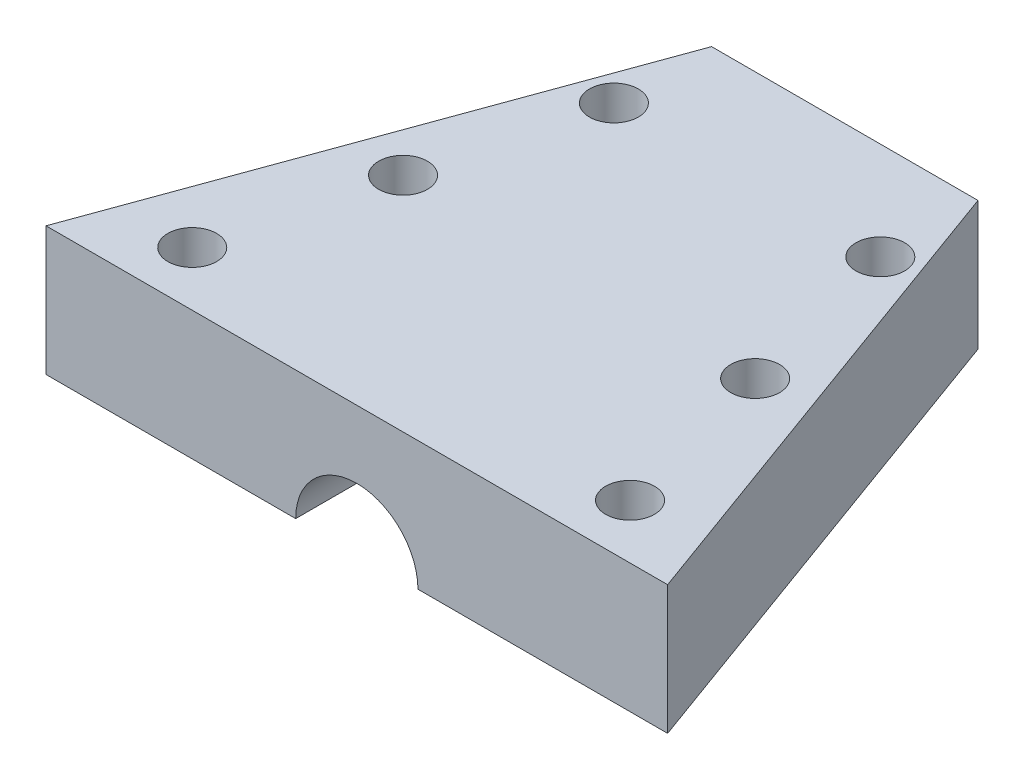
ISO-10303-21;
HEADER;
FILE_DESCRIPTION(('STEP AP214'),'2;1');
FILE_NAME('part.step','',(''),(''),'','','');
FILE_SCHEMA(('AUTOMOTIVE_DESIGN { 1 0 10303 214 1 1 1 1 }'));
ENDSEC;
DATA;
#1=APPLICATION_CONTEXT('core data for automotive mechanical design processes');
#2=APPLICATION_PROTOCOL_DEFINITION('international standard','automotive_design',2000,#1);
#3=PRODUCT_CONTEXT('',#1,'mechanical');
#4=PRODUCT('Part','Part','',(#3));
#5=PRODUCT_RELATED_PRODUCT_CATEGORY('part','',(#4));
#6=PRODUCT_DEFINITION_FORMATION('','',#4);
#7=PRODUCT_DEFINITION_CONTEXT('part definition',#1,'design');
#8=PRODUCT_DEFINITION('design','',#6,#7);
#9=PRODUCT_DEFINITION_SHAPE('','',#8);
#10=(LENGTH_UNIT() NAMED_UNIT(*) SI_UNIT(.MILLI.,.METRE.));
#11=(NAMED_UNIT(*) PLANE_ANGLE_UNIT() SI_UNIT($,.RADIAN.));
#12=(NAMED_UNIT(*) SI_UNIT($,.STERADIAN.) SOLID_ANGLE_UNIT());
#13=UNCERTAINTY_MEASURE_WITH_UNIT(LENGTH_MEASURE(1.E-05),#10,'distance_accuracy_value','');
#14=(GEOMETRIC_REPRESENTATION_CONTEXT(3) GLOBAL_UNCERTAINTY_ASSIGNED_CONTEXT((#13)) GLOBAL_UNIT_ASSIGNED_CONTEXT((#10,
#11,#12)) REPRESENTATION_CONTEXT('',''));
#15=CARTESIAN_POINT('',(0.,0.,0.));
#16=DIRECTION('',(0.,0.,1.));
#17=DIRECTION('',(1.,0.,0.));
#18=AXIS2_PLACEMENT_3D('',#15,#16,#17);
#19=CARTESIAN_POINT('',(0.,0.,0.));
#20=DIRECTION('',(0.,-1.,0.));
#21=DIRECTION('',(0.,0.,-1.));
#22=AXIS2_PLACEMENT_3D('',#19,#20,#21);
#23=PLANE('',#22);
#24=CARTESIAN_POINT('',(22.8130859440281,0.,43.049100152102));
#25=DIRECTION('',(0.,1.,0.));
#26=DIRECTION('',(0.,0.,1.));
#27=AXIS2_PLACEMENT_3D('',#24,#25,#26);
#28=CIRCLE('',#27,2.749999961);
#29=CARTESIAN_POINT('',(22.8130859440281,0.,45.799100113102));
#30=VERTEX_POINT('',#29);
#31=EDGE_CURVE('E176',#30,#30,#28,.T.);
#32=ORIENTED_EDGE('',*,*,#31,.T.);
#33=EDGE_LOOP('',(#32));
#34=FACE_BOUND('',#33,.T.);
#35=CARTESIAN_POINT('',(13.163085944028,0.,5.21664648822295));
#36=DIRECTION('',(0.,1.,0.));
#37=DIRECTION('',(0.,0.,1.));
#38=AXIS2_PLACEMENT_3D('',#35,#36,#37);
#39=CIRCLE('',#38,2.749999961);
#40=CARTESIAN_POINT('',(13.163085944028,0.,7.96664644922295));
#41=VERTEX_POINT('',#40);
#42=EDGE_CURVE('E158',#41,#41,#39,.T.);
#43=ORIENTED_EDGE('',*,*,#42,.T.);
#44=EDGE_LOOP('',(#43));
#45=FACE_BOUND('',#44,.T.);
#46=CARTESIAN_POINT('',(17.9880859440281,0.,24.1328733201625));
#47=DIRECTION('',(0.,1.,0.));
#48=DIRECTION('',(0.,0.,1.));
#49=AXIS2_PLACEMENT_3D('',#46,#47,#48);
#50=CIRCLE('',#49,2.749999961);
#51=CARTESIAN_POINT('',(17.9880859440281,0.,26.8828732811625));
#52=VERTEX_POINT('',#51);
#53=EDGE_CURVE('E107',#52,#52,#50,.T.);
#54=ORIENTED_EDGE('',*,*,#53,.T.);
#55=EDGE_LOOP('',(#54));
#56=FACE_BOUND('',#55,.T.);
#57=DIRECTION('',(0.,0.,1.));
#58=VECTOR('',#57,1.);
#59=CARTESIAN_POINT('',(5.04769268169056,0.,-38.833805122684));
#60=LINE('',#59,#58);
#61=CARTESIAN_POINT('',(5.04769268169056,0.,-5.78335351177704));
#62=VERTEX_POINT('',#61);
#63=CARTESIAN_POINT('',(5.04769268169056,0.,49.166194877316));
#64=VERTEX_POINT('',#63);
#65=EDGE_CURVE('E11',#62,#64,#60,.T.);
#66=ORIENTED_EDGE('',*,*,#65,.F.);
#67=DIRECTION('',(1.,0.,0.));
#68=VECTOR('',#67,1.);
#69=CARTESIAN_POINT('',(-16.8369140559719,0.,-5.78335351177704));
#70=LINE('',#69,#68);
#71=CARTESIAN_POINT('',(13.163085944028,0.,-5.78335351177704));
#72=VERTEX_POINT('',#71);
#73=EDGE_CURVE('E113',#62,#72,#70,.T.);
#74=ORIENTED_EDGE('',*,*,#73,.T.);
#75=DIRECTION('',(0.342020143325666,0.,0.939692620785909));
#76=VECTOR('',#75,1.);
#77=CARTESIAN_POINT('',(13.163085944028,0.,-5.78335351177704));
#78=LINE('',#77,#76);
#79=CARTESIAN_POINT('',(33.1630859440281,0.,49.166194877316));
#80=VERTEX_POINT('',#79);
#81=EDGE_CURVE('E109',#72,#80,#78,.T.);
#82=ORIENTED_EDGE('',*,*,#81,.T.);
#83=DIRECTION('',(-1.,0.,0.));
#84=VECTOR('',#83,1.);
#85=CARTESIAN_POINT('',(33.1630859440281,0.,49.166194877316));
#86=LINE('',#85,#84);
#87=EDGE_CURVE('E104',#80,#64,#86,.T.);
#88=ORIENTED_EDGE('',*,*,#87,.T.);
#89=EDGE_LOOP('',(#66,#74,#82,#88));
#90=FACE_BOUND('',#89,.T.);
#91=ADVANCED_FACE('F37',(#34,#45,#56,#90),#23,.T.);
#92=CARTESIAN_POINT('',(33.1630859440281,14.5,49.166194877316));
#93=DIRECTION('',(0.,0.,1.));
#94=DIRECTION('',(1.,0.,0.));
#95=AXIS2_PLACEMENT_3D('',#92,#93,#94);
#96=PLANE('',#95);
#97=CARTESIAN_POINT('',(-1.83691405597191,0.,49.166194877316));
#98=DIRECTION('',(0.,0.,1.));
#99=DIRECTION('',(1.,0.,0.));
#100=AXIS2_PLACEMENT_3D('',#97,#98,#99);
#101=CIRCLE('',#100,6.88460673766247);
#102=CARTESIAN_POINT('',(-8.72152079363438,0.,49.166194877316));
#103=VERTEX_POINT('',#102);
#104=EDGE_CURVE('E51',#64,#103,#101,.T.);
#105=ORIENTED_EDGE('',*,*,#104,.F.);
#106=ORIENTED_EDGE('',*,*,#87,.F.);
#107=DIRECTION('',(0.,-1.,0.));
#108=VECTOR('',#107,1.);
#109=CARTESIAN_POINT('',(33.1630859440281,14.5,49.166194877316));
#110=LINE('',#109,#108);
#111=CARTESIAN_POINT('',(33.1630859440281,14.5,49.166194877316));
#112=VERTEX_POINT('',#111);
#113=EDGE_CURVE('E60',#112,#80,#110,.T.);
#114=ORIENTED_EDGE('',*,*,#113,.F.);
#115=DIRECTION('',(-1.,0.,0.));
#116=VECTOR('',#115,1.);
#117=CARTESIAN_POINT('',(33.1630859440281,14.5,49.166194877316));
#118=LINE('',#117,#116);
#119=CARTESIAN_POINT('',(-36.8369140559719,14.5,49.166194877316));
#120=VERTEX_POINT('',#119);
#121=EDGE_CURVE('E123',#112,#120,#118,.T.);
#122=ORIENTED_EDGE('',*,*,#121,.T.);
#123=DIRECTION('',(0.,-1.,0.));
#124=VECTOR('',#123,1.);
#125=CARTESIAN_POINT('',(-36.8369140559719,14.5,49.166194877316));
#126=LINE('',#125,#124);
#127=CARTESIAN_POINT('',(-36.8369140559719,0.,49.166194877316));
#128=VERTEX_POINT('',#127);
#129=EDGE_CURVE('E87',#120,#128,#126,.T.);
#130=ORIENTED_EDGE('',*,*,#129,.T.);
#131=EDGE_CURVE('E106',#103,#128,#86,.T.);
#132=ORIENTED_EDGE('',*,*,#131,.F.);
#133=EDGE_LOOP('',(#105,#106,#114,#122,#130,#132));
#134=FACE_BOUND('',#133,.T.);
#135=ADVANCED_FACE('F39',(#134),#96,.T.);
#136=CARTESIAN_POINT('',(13.163085944028,14.5,-5.78335351177704));
#137=DIRECTION('',(0.939692620785909,0.,-0.342020143325666));
#138=DIRECTION('',(-0.342020143325666,0.,-0.93969262078591));
#139=AXIS2_PLACEMENT_3D('',#136,#137,#138);
#140=PLANE('',#139);
#141=ORIENTED_EDGE('',*,*,#81,.F.);
#142=DIRECTION('',(0.,-1.,0.));
#143=VECTOR('',#142,1.);
#144=CARTESIAN_POINT('',(13.163085944028,14.5,-5.78335351177704));
#145=LINE('',#144,#143);
#146=CARTESIAN_POINT('',(13.163085944028,14.5,-5.78335351177704));
#147=VERTEX_POINT('',#146);
#148=EDGE_CURVE('E125',#147,#72,#145,.T.);
#149=ORIENTED_EDGE('',*,*,#148,.F.);
#150=DIRECTION('',(0.342020143325666,0.,0.939692620785909));
#151=VECTOR('',#150,1.);
#152=CARTESIAN_POINT('',(13.163085944028,14.5,-5.78335351177704));
#153=LINE('',#152,#151);
#154=EDGE_CURVE('E116',#147,#112,#153,.T.);
#155=ORIENTED_EDGE('',*,*,#154,.T.);
#156=ORIENTED_EDGE('',*,*,#113,.T.);
#157=EDGE_LOOP('',(#141,#149,#155,#156));
#158=FACE_BOUND('',#157,.T.);
#159=ADVANCED_FACE('F218',(#158),#140,.T.);
#160=CARTESIAN_POINT('',(-16.8369140559719,14.5,-5.78335351177704));
#161=DIRECTION('',(0.,0.,-1.));
#162=DIRECTION('',(-1.,0.,0.));
#163=AXIS2_PLACEMENT_3D('',#160,#161,#162);
#164=PLANE('',#163);
#165=CARTESIAN_POINT('',(-1.83691405597191,0.,-5.78335351177704));
#166=DIRECTION('',(0.,0.,-1.));
#167=DIRECTION('',(-1.,0.,0.));
#168=AXIS2_PLACEMENT_3D('',#165,#166,#167);
#169=CIRCLE('',#168,6.88460673766247);
#170=CARTESIAN_POINT('',(-8.72152079363438,0.,-5.78335351177704));
#171=VERTEX_POINT('',#170);
#172=EDGE_CURVE('E99',#171,#62,#169,.T.);
#173=ORIENTED_EDGE('',*,*,#172,.F.);
#174=CARTESIAN_POINT('',(-16.8369140559719,0.,-5.78335351177704));
#175=VERTEX_POINT('',#174);
#176=EDGE_CURVE('E119',#175,#171,#70,.T.);
#177=ORIENTED_EDGE('',*,*,#176,.F.);
#178=DIRECTION('',(0.,-1.,0.));
#179=VECTOR('',#178,1.);
#180=CARTESIAN_POINT('',(-16.8369140559719,14.5,-5.78335351177704));
#181=LINE('',#180,#179);
#182=CARTESIAN_POINT('',(-16.8369140559719,14.5,-5.78335351177704));
#183=VERTEX_POINT('',#182);
#184=EDGE_CURVE('E128',#183,#175,#181,.T.);
#185=ORIENTED_EDGE('',*,*,#184,.F.);
#186=DIRECTION('',(1.,0.,0.));
#187=VECTOR('',#186,1.);
#188=CARTESIAN_POINT('',(-16.8369140559719,14.5,-5.78335351177704));
#189=LINE('',#188,#187);
#190=EDGE_CURVE('E140',#183,#147,#189,.T.);
#191=ORIENTED_EDGE('',*,*,#190,.T.);
#192=ORIENTED_EDGE('',*,*,#148,.T.);
#193=ORIENTED_EDGE('',*,*,#73,.F.);
#194=EDGE_LOOP('',(#173,#177,#185,#191,#192,#193));
#195=FACE_BOUND('',#194,.T.);
#196=ADVANCED_FACE('F133',(#195),#164,.T.);
#197=CARTESIAN_POINT('',(-36.8369140559719,14.5,49.166194877316));
#198=DIRECTION('',(-0.93969262078591,0.,-0.342020143325665));
#199=DIRECTION('',(-0.342020143325665,0.,0.93969262078591));
#200=AXIS2_PLACEMENT_3D('',#197,#198,#199);
#201=PLANE('',#200);
#202=DIRECTION('',(0.342020143325665,0.,-0.93969262078591));
#203=VECTOR('',#202,1.);
#204=CARTESIAN_POINT('',(-36.8369140559719,0.,49.166194877316));
#205=LINE('',#204,#203);
#206=EDGE_CURVE('E110',#128,#175,#205,.T.);
#207=ORIENTED_EDGE('',*,*,#206,.F.);
#208=ORIENTED_EDGE('',*,*,#129,.F.);
#209=DIRECTION('',(0.342020143325665,0.,-0.93969262078591));
#210=VECTOR('',#209,1.);
#211=CARTESIAN_POINT('',(-36.8369140559719,14.5,49.166194877316));
#212=LINE('',#211,#210);
#213=EDGE_CURVE('E137',#120,#183,#212,.T.);
#214=ORIENTED_EDGE('',*,*,#213,.T.);
#215=ORIENTED_EDGE('',*,*,#184,.T.);
#216=EDGE_LOOP('',(#207,#208,#214,#215));
#217=FACE_BOUND('',#216,.T.);
#218=ADVANCED_FACE('F136',(#217),#201,.T.);
#219=CARTESIAN_POINT('',(0.,14.5,0.));
#220=DIRECTION('',(0.,-1.,0.));
#221=DIRECTION('',(0.,0.,-1.));
#222=AXIS2_PLACEMENT_3D('',#219,#220,#221);
#223=PLANE('',#222);
#224=CARTESIAN_POINT('',(22.8130859440281,14.5,43.049100152102));
#225=DIRECTION('',(0.,1.,0.));
#226=DIRECTION('',(0.,0.,1.));
#227=AXIS2_PLACEMENT_3D('',#224,#225,#226);
#228=CIRCLE('',#227,2.749999961);
#229=CARTESIAN_POINT('',(22.8130859440281,14.5,45.799100113102));
#230=VERTEX_POINT('',#229);
#231=EDGE_CURVE('E179',#230,#230,#228,.T.);
#232=ORIENTED_EDGE('',*,*,#231,.F.);
#233=EDGE_LOOP('',(#232));
#234=FACE_BOUND('',#233,.T.);
#235=CARTESIAN_POINT('',(-26.4869140559719,14.5,43.049100152102));
#236=DIRECTION('',(0.,1.,0.));
#237=DIRECTION('',(0.,0.,1.));
#238=AXIS2_PLACEMENT_3D('',#235,#236,#237);
#239=CIRCLE('',#238,2.749999961);
#240=CARTESIAN_POINT('',(-26.4869140559719,14.5,45.799100113102));
#241=VERTEX_POINT('',#240);
#242=EDGE_CURVE('E173',#241,#241,#239,.T.);
#243=ORIENTED_EDGE('',*,*,#242,.F.);
#244=EDGE_LOOP('',(#243));
#245=FACE_BOUND('',#244,.T.);
#246=CARTESIAN_POINT('',(-16.8369140559719,14.5,5.21664648822296));
#247=DIRECTION('',(0.,1.,0.));
#248=DIRECTION('',(0.,0.,1.));
#249=AXIS2_PLACEMENT_3D('',#246,#247,#248);
#250=CIRCLE('',#249,2.749999961);
#251=CARTESIAN_POINT('',(-16.8369140559719,14.5,7.96664644922295));
#252=VERTEX_POINT('',#251);
#253=EDGE_CURVE('E167',#252,#252,#250,.T.);
#254=ORIENTED_EDGE('',*,*,#253,.F.);
#255=EDGE_LOOP('',(#254));
#256=FACE_BOUND('',#255,.T.);
#257=CARTESIAN_POINT('',(13.163085944028,14.5,5.21664648822295));
#258=DIRECTION('',(0.,1.,0.));
#259=DIRECTION('',(0.,0.,1.));
#260=AXIS2_PLACEMENT_3D('',#257,#258,#259);
#261=CIRCLE('',#260,2.749999961);
#262=CARTESIAN_POINT('',(13.163085944028,14.5,7.96664644922295));
#263=VERTEX_POINT('',#262);
#264=EDGE_CURVE('E161',#263,#263,#261,.T.);
#265=ORIENTED_EDGE('',*,*,#264,.F.);
#266=EDGE_LOOP('',(#265));
#267=FACE_BOUND('',#266,.T.);
#268=CARTESIAN_POINT('',(-21.6619140559719,14.5,24.1328733201625));
#269=DIRECTION('',(0.,1.,0.));
#270=DIRECTION('',(0.,0.,1.));
#271=AXIS2_PLACEMENT_3D('',#268,#269,#270);
#272=CIRCLE('',#271,2.749999961);
#273=CARTESIAN_POINT('',(-21.6619140559719,14.5,26.8828732811625));
#274=VERTEX_POINT('',#273);
#275=EDGE_CURVE('E155',#274,#274,#272,.T.);
#276=ORIENTED_EDGE('',*,*,#275,.F.);
#277=EDGE_LOOP('',(#276));
#278=FACE_BOUND('',#277,.T.);
#279=CARTESIAN_POINT('',(17.9880859440281,14.5,24.1328733201625));
#280=DIRECTION('',(0.,1.,0.));
#281=DIRECTION('',(0.,0.,1.));
#282=AXIS2_PLACEMENT_3D('',#279,#280,#281);
#283=CIRCLE('',#282,2.749999961);
#284=CARTESIAN_POINT('',(17.9880859440281,14.5,26.8828732811625));
#285=VERTEX_POINT('',#284);
#286=EDGE_CURVE('E149',#285,#285,#283,.T.);
#287=ORIENTED_EDGE('',*,*,#286,.F.);
#288=EDGE_LOOP('',(#287));
#289=FACE_BOUND('',#288,.T.);
#290=ORIENTED_EDGE('',*,*,#121,.F.);
#291=ORIENTED_EDGE('',*,*,#154,.F.);
#292=ORIENTED_EDGE('',*,*,#190,.F.);
#293=ORIENTED_EDGE('',*,*,#213,.F.);
#294=EDGE_LOOP('',(#290,#291,#292,#293));
#295=FACE_BOUND('',#294,.T.);
#296=ADVANCED_FACE('F143',(#234,#245,#256,#267,#278,#289,#295),#223,.F.);
#297=CARTESIAN_POINT('',(-26.4869140559719,0.,43.049100152102));
#298=DIRECTION('',(0.,1.,0.));
#299=DIRECTION('',(0.,0.,1.));
#300=AXIS2_PLACEMENT_3D('',#297,#298,#299);
#301=CIRCLE('',#300,2.749999961);
#302=CARTESIAN_POINT('',(-26.4869140559719,0.,45.799100113102));
#303=VERTEX_POINT('',#302);
#304=EDGE_CURVE('E170',#303,#303,#301,.T.);
#305=ORIENTED_EDGE('',*,*,#304,.T.);
#306=EDGE_LOOP('',(#305));
#307=FACE_BOUND('',#306,.T.);
#308=CARTESIAN_POINT('',(-16.8369140559719,0.,5.21664648822296));
#309=DIRECTION('',(0.,1.,0.));
#310=DIRECTION('',(0.,0.,1.));
#311=AXIS2_PLACEMENT_3D('',#308,#309,#310);
#312=CIRCLE('',#311,2.749999961);
#313=CARTESIAN_POINT('',(-16.8369140559719,0.,7.96664644922295));
#314=VERTEX_POINT('',#313);
#315=EDGE_CURVE('E164',#314,#314,#312,.T.);
#316=ORIENTED_EDGE('',*,*,#315,.T.);
#317=EDGE_LOOP('',(#316));
#318=FACE_BOUND('',#317,.T.);
#319=CARTESIAN_POINT('',(-21.6619140559719,0.,24.1328733201625));
#320=DIRECTION('',(0.,1.,0.));
#321=DIRECTION('',(0.,0.,1.));
#322=AXIS2_PLACEMENT_3D('',#319,#320,#321);
#323=CIRCLE('',#322,2.749999961);
#324=CARTESIAN_POINT('',(-21.6619140559719,0.,26.8828732811625));
#325=VERTEX_POINT('',#324);
#326=EDGE_CURVE('E152',#325,#325,#323,.T.);
#327=ORIENTED_EDGE('',*,*,#326,.T.);
#328=EDGE_LOOP('',(#327));
#329=FACE_BOUND('',#328,.T.);
#330=DIRECTION('',(0.,0.,1.));
#331=VECTOR('',#330,1.);
#332=CARTESIAN_POINT('',(-8.72152079363438,0.,-38.833805122684));
#333=LINE('',#332,#331);
#334=EDGE_CURVE('E45',#103,#171,#333,.F.);
#335=ORIENTED_EDGE('',*,*,#334,.F.);
#336=ORIENTED_EDGE('',*,*,#131,.T.);
#337=ORIENTED_EDGE('',*,*,#206,.T.);
#338=ORIENTED_EDGE('',*,*,#176,.T.);
#339=EDGE_LOOP('',(#335,#336,#337,#338));
#340=FACE_BOUND('',#339,.T.);
#341=ADVANCED_FACE('F135',(#307,#318,#329,#340),#23,.T.);
#342=CARTESIAN_POINT('',(-1.83691405597191,0.,-38.833805122684));
#343=DIRECTION('',(0.,0.,1.));
#344=DIRECTION('',(1.,0.,0.));
#345=AXIS2_PLACEMENT_3D('',#342,#343,#344);
#346=CYLINDRICAL_SURFACE('',#345,6.88460673766247);
#347=ORIENTED_EDGE('',*,*,#65,.T.);
#348=ORIENTED_EDGE('',*,*,#104,.T.);
#349=ORIENTED_EDGE('',*,*,#334,.T.);
#350=ORIENTED_EDGE('',*,*,#172,.T.);
#351=EDGE_LOOP('',(#347,#348,#349,#350));
#352=FACE_BOUND('',#351,.T.);
#353=ADVANCED_FACE('F97',(#352),#346,.F.);
#354=CARTESIAN_POINT('',(17.9880859440281,14.5,24.1328733201625));
#355=DIRECTION('',(0.,1.,0.));
#356=DIRECTION('',(0.,0.,1.));
#357=AXIS2_PLACEMENT_3D('',#354,#355,#356);
#358=CYLINDRICAL_SURFACE('',#357,2.749999961);
#359=ORIENTED_EDGE('',*,*,#53,.F.);
#360=EDGE_LOOP('',(#359));
#361=FACE_BOUND('',#360,.T.);
#362=ORIENTED_EDGE('',*,*,#286,.T.);
#363=EDGE_LOOP('',(#362));
#364=FACE_BOUND('',#363,.T.);
#365=ADVANCED_FACE('F198',(#361,#364),#358,.F.);
#366=CARTESIAN_POINT('',(-21.6619140559719,14.5,24.1328733201625));
#367=DIRECTION('',(0.,1.,0.));
#368=DIRECTION('',(0.,0.,1.));
#369=AXIS2_PLACEMENT_3D('',#366,#367,#368);
#370=CYLINDRICAL_SURFACE('',#369,2.749999961);
#371=ORIENTED_EDGE('',*,*,#326,.F.);
#372=EDGE_LOOP('',(#371));
#373=FACE_BOUND('',#372,.T.);
#374=ORIENTED_EDGE('',*,*,#275,.T.);
#375=EDGE_LOOP('',(#374));
#376=FACE_BOUND('',#375,.T.);
#377=ADVANCED_FACE('F200',(#373,#376),#370,.F.);
#378=CARTESIAN_POINT('',(13.163085944028,14.5,5.21664648822295));
#379=DIRECTION('',(0.,1.,0.));
#380=DIRECTION('',(0.,0.,1.));
#381=AXIS2_PLACEMENT_3D('',#378,#379,#380);
#382=CYLINDRICAL_SURFACE('',#381,2.749999961);
#383=ORIENTED_EDGE('',*,*,#42,.F.);
#384=EDGE_LOOP('',(#383));
#385=FACE_BOUND('',#384,.T.);
#386=ORIENTED_EDGE('',*,*,#264,.T.);
#387=EDGE_LOOP('',(#386));
#388=FACE_BOUND('',#387,.T.);
#389=ADVANCED_FACE('F207',(#385,#388),#382,.F.);
#390=CARTESIAN_POINT('',(-16.8369140559719,14.5,5.21664648822296));
#391=DIRECTION('',(0.,1.,0.));
#392=DIRECTION('',(0.,0.,1.));
#393=AXIS2_PLACEMENT_3D('',#390,#391,#392);
#394=CYLINDRICAL_SURFACE('',#393,2.749999961);
#395=ORIENTED_EDGE('',*,*,#315,.F.);
#396=EDGE_LOOP('',(#395));
#397=FACE_BOUND('',#396,.T.);
#398=ORIENTED_EDGE('',*,*,#253,.T.);
#399=EDGE_LOOP('',(#398));
#400=FACE_BOUND('',#399,.T.);
#401=ADVANCED_FACE('F232',(#397,#400),#394,.F.);
#402=CARTESIAN_POINT('',(-26.4869140559719,14.5,43.049100152102));
#403=DIRECTION('',(0.,1.,0.));
#404=DIRECTION('',(0.,0.,1.));
#405=AXIS2_PLACEMENT_3D('',#402,#403,#404);
#406=CYLINDRICAL_SURFACE('',#405,2.749999961);
#407=ORIENTED_EDGE('',*,*,#304,.F.);
#408=EDGE_LOOP('',(#407));
#409=FACE_BOUND('',#408,.T.);
#410=ORIENTED_EDGE('',*,*,#242,.T.);
#411=EDGE_LOOP('',(#410));
#412=FACE_BOUND('',#411,.T.);
#413=ADVANCED_FACE('F235',(#409,#412),#406,.F.);
#414=CARTESIAN_POINT('',(22.8130859440281,14.5,43.049100152102));
#415=DIRECTION('',(0.,1.,0.));
#416=DIRECTION('',(0.,0.,1.));
#417=AXIS2_PLACEMENT_3D('',#414,#415,#416);
#418=CYLINDRICAL_SURFACE('',#417,2.749999961);
#419=ORIENTED_EDGE('',*,*,#31,.F.);
#420=EDGE_LOOP('',(#419));
#421=FACE_BOUND('',#420,.T.);
#422=ORIENTED_EDGE('',*,*,#231,.T.);
#423=EDGE_LOOP('',(#422));
#424=FACE_BOUND('',#423,.T.);
#425=ADVANCED_FACE('F183',(#421,#424),#418,.F.);
#426=CLOSED_SHELL('',(#91,#135,#159,#196,#218,#296,#341,#353,#365,#377,#389,#401,#413,#425));
#427=MANIFOLD_SOLID_BREP('B2',#426);
#428=ADVANCED_BREP_SHAPE_REPRESENTATION('',(#18,#427),#14);
#429=SHAPE_DEFINITION_REPRESENTATION(#9,#428);
ENDSEC;
END-ISO-10303-21;
